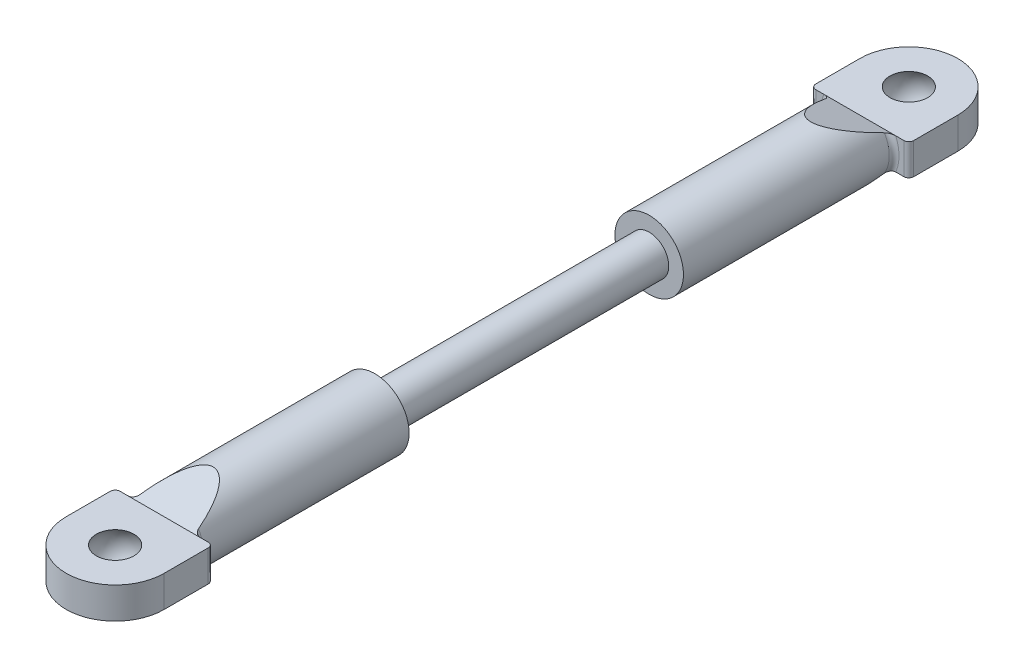
ISO-10303-21;
HEADER;
FILE_DESCRIPTION(('STEP AP214'),'2;1');
FILE_NAME('part.step','',(''),(''),'','','');
FILE_SCHEMA(('AUTOMOTIVE_DESIGN { 1 0 10303 214 1 1 1 1 }'));
ENDSEC;
DATA;
#1=APPLICATION_CONTEXT('core data for automotive mechanical design processes');
#2=APPLICATION_PROTOCOL_DEFINITION('international standard','automotive_design',2000,#1);
#3=PRODUCT_CONTEXT('',#1,'mechanical');
#4=PRODUCT('Part','Part','',(#3));
#5=PRODUCT_RELATED_PRODUCT_CATEGORY('part','',(#4));
#6=PRODUCT_DEFINITION_FORMATION('','',#4);
#7=PRODUCT_DEFINITION_CONTEXT('part definition',#1,'design');
#8=PRODUCT_DEFINITION('design','',#6,#7);
#9=PRODUCT_DEFINITION_SHAPE('','',#8);
#10=(LENGTH_UNIT() NAMED_UNIT(*) SI_UNIT(.MILLI.,.METRE.));
#11=(NAMED_UNIT(*) PLANE_ANGLE_UNIT() SI_UNIT($,.RADIAN.));
#12=(NAMED_UNIT(*) SI_UNIT($,.STERADIAN.) SOLID_ANGLE_UNIT());
#13=UNCERTAINTY_MEASURE_WITH_UNIT(LENGTH_MEASURE(1.E-05),#10,'distance_accuracy_value','');
#14=(GEOMETRIC_REPRESENTATION_CONTEXT(3) GLOBAL_UNCERTAINTY_ASSIGNED_CONTEXT((#13)) GLOBAL_UNIT_ASSIGNED_CONTEXT((#10,
#11,#12)) REPRESENTATION_CONTEXT('',''));
#15=CARTESIAN_POINT('',(0.,0.,0.));
#16=DIRECTION('',(0.,0.,1.));
#17=DIRECTION('',(1.,0.,0.));
#18=AXIS2_PLACEMENT_3D('',#15,#16,#17);
#19=CARTESIAN_POINT('',(0.,0.,-35.5));
#20=DIRECTION('',(0.,0.,1.));
#21=DIRECTION('',(1.,0.,0.));
#22=AXIS2_PLACEMENT_3D('',#19,#20,#21);
#23=CYLINDRICAL_SURFACE('',#22,3.5);
#24=CARTESIAN_POINT('',(0.,0.,-14.));
#25=DIRECTION('',(0.,0.,1.));
#26=DIRECTION('',(1.,0.,0.));
#27=AXIS2_PLACEMENT_3D('',#24,#25,#26);
#28=CIRCLE('',#27,3.5);
#29=CARTESIAN_POINT('',(3.5,0.,-14.));
#30=VERTEX_POINT('',#29);
#31=EDGE_CURVE('E184',#30,#30,#28,.T.);
#32=ORIENTED_EDGE('',*,*,#31,.F.);
#33=EDGE_LOOP('',(#32));
#34=FACE_BOUND('',#33,.T.);
#35=CARTESIAN_POINT('',(0.,0.,-39.7105263157895));
#36=DIRECTION('',(0.,0.934783580588349,-0.355217760623573));
#37=DIRECTION('',(0.,0.355217760623573,0.934783580588349));
#38=AXIS2_PLACEMENT_3D('',#35,#36,#37);
#39=ELLIPSE('',#38,9.8531109307594,3.5);
#40=CARTESIAN_POINT('',(3.00764027104307,1.79,-35.));
#41=VERTEX_POINT('',#40);
#42=CARTESIAN_POINT('',(-3.00764027104307,1.79,-35.));
#43=VERTEX_POINT('',#42);
#44=EDGE_CURVE('E517',#41,#43,#39,.F.);
#45=ORIENTED_EDGE('',*,*,#44,.T.);
#46=CARTESIAN_POINT('',(0.,0.,-35.));
#47=DIRECTION('',(0.,0.,1.));
#48=DIRECTION('',(1.,0.,0.));
#49=AXIS2_PLACEMENT_3D('',#46,#47,#48);
#50=CIRCLE('',#49,3.5);
#51=CARTESIAN_POINT('',(-3.00764027104307,-1.79,-35.));
#52=VERTEX_POINT('',#51);
#53=EDGE_CURVE('E369',#43,#52,#50,.T.);
#54=ORIENTED_EDGE('',*,*,#53,.T.);
#55=CARTESIAN_POINT('',(0.,0.,-39.7105263157895));
#56=DIRECTION('',(0.,-0.934783580588349,-0.355217760623573));
#57=DIRECTION('',(0.,-0.355217760623573,0.934783580588349));
#58=AXIS2_PLACEMENT_3D('',#55,#56,#57);
#59=ELLIPSE('',#58,9.8531109307594,3.5);
#60=CARTESIAN_POINT('',(3.00764027104307,-1.79,-35.));
#61=VERTEX_POINT('',#60);
#62=EDGE_CURVE('E208',#52,#61,#59,.F.);
#63=ORIENTED_EDGE('',*,*,#62,.T.);
#64=CARTESIAN_POINT('',(0.,0.,-35.));
#65=DIRECTION('',(0.,0.,1.));
#66=DIRECTION('',(1.,0.,0.));
#67=AXIS2_PLACEMENT_3D('',#64,#65,#66);
#68=CIRCLE('',#67,3.5);
#69=EDGE_CURVE('E366',#61,#41,#68,.T.);
#70=ORIENTED_EDGE('',*,*,#69,.T.);
#71=EDGE_LOOP('',(#45,#54,#63,#70));
#72=FACE_BOUND('',#71,.T.);
#73=ADVANCED_FACE('F34',(#34,#72),#23,.T.);
#74=CARTESIAN_POINT('',(0.,0.,14.));
#75=DIRECTION('',(0.,0.,-1.));
#76=DIRECTION('',(-1.,0.,0.));
#77=AXIS2_PLACEMENT_3D('',#74,#75,#76);
#78=CYLINDRICAL_SURFACE('',#77,2.);
#79=CARTESIAN_POINT('',(0.,0.,14.));
#80=DIRECTION('',(0.,0.,1.));
#81=DIRECTION('',(1.,0.,0.));
#82=AXIS2_PLACEMENT_3D('',#79,#80,#81);
#83=CIRCLE('',#82,2.);
#84=CARTESIAN_POINT('',(2.,0.,14.));
#85=VERTEX_POINT('',#84);
#86=EDGE_CURVE('E267',#85,#85,#83,.T.);
#87=ORIENTED_EDGE('',*,*,#86,.F.);
#88=EDGE_LOOP('',(#87));
#89=FACE_BOUND('',#88,.T.);
#90=CARTESIAN_POINT('',(0.,0.,-14.));
#91=DIRECTION('',(0.,0.,-1.));
#92=DIRECTION('',(-1.,0.,0.));
#93=AXIS2_PLACEMENT_3D('',#90,#91,#92);
#94=CIRCLE('',#93,2.);
#95=CARTESIAN_POINT('',(-2.,0.,-14.));
#96=VERTEX_POINT('',#95);
#97=EDGE_CURVE('E219',#96,#96,#94,.T.);
#98=ORIENTED_EDGE('',*,*,#97,.F.);
#99=EDGE_LOOP('',(#98));
#100=FACE_BOUND('',#99,.T.);
#101=ADVANCED_FACE('F429',(#89,#100),#78,.T.);
#102=CARTESIAN_POINT('',(0.,0.,35.5));
#103=DIRECTION('',(0.,0.,-1.));
#104=DIRECTION('',(-1.,0.,0.));
#105=AXIS2_PLACEMENT_3D('',#102,#103,#104);
#106=CYLINDRICAL_SURFACE('',#105,3.5);
#107=CARTESIAN_POINT('',(0.,0.,39.7105263157895));
#108=DIRECTION('',(0.,0.934783580588349,-0.355217760623573));
#109=DIRECTION('',(0.,-0.355217760623573,-0.934783580588349));
#110=AXIS2_PLACEMENT_3D('',#107,#108,#109);
#111=ELLIPSE('',#110,9.8531109307594,3.5);
#112=CARTESIAN_POINT('',(3.00764027104307,-1.79,35.));
#113=VERTEX_POINT('',#112);
#114=CARTESIAN_POINT('',(-3.00764027104307,-1.79,35.));
#115=VERTEX_POINT('',#114);
#116=EDGE_CURVE('E231',#113,#115,#111,.T.);
#117=ORIENTED_EDGE('',*,*,#116,.T.);
#118=CARTESIAN_POINT('',(0.,0.,35.));
#119=DIRECTION('',(0.,0.,1.));
#120=DIRECTION('',(1.,0.,0.));
#121=AXIS2_PLACEMENT_3D('',#118,#119,#120);
#122=CIRCLE('',#121,3.5);
#123=CARTESIAN_POINT('',(-3.00764027104307,1.79,35.));
#124=VERTEX_POINT('',#123);
#125=EDGE_CURVE('E288',#115,#124,#122,.F.);
#126=ORIENTED_EDGE('',*,*,#125,.T.);
#127=CARTESIAN_POINT('',(0.,0.,39.7105263157895));
#128=DIRECTION('',(0.,-0.934783580588349,-0.355217760623573));
#129=DIRECTION('',(0.,0.355217760623573,-0.934783580588349));
#130=AXIS2_PLACEMENT_3D('',#127,#128,#129);
#131=ELLIPSE('',#130,9.8531109307594,3.5);
#132=CARTESIAN_POINT('',(3.00764027104307,1.79,35.));
#133=VERTEX_POINT('',#132);
#134=EDGE_CURVE('E228',#124,#133,#131,.T.);
#135=ORIENTED_EDGE('',*,*,#134,.T.);
#136=CARTESIAN_POINT('',(0.,0.,35.));
#137=DIRECTION('',(0.,0.,1.));
#138=DIRECTION('',(1.,0.,0.));
#139=AXIS2_PLACEMENT_3D('',#136,#137,#138);
#140=CIRCLE('',#139,3.5);
#141=EDGE_CURVE('E286',#133,#113,#140,.F.);
#142=ORIENTED_EDGE('',*,*,#141,.T.);
#143=EDGE_LOOP('',(#117,#126,#135,#142));
#144=FACE_BOUND('',#143,.T.);
#145=CARTESIAN_POINT('',(0.,0.,14.));
#146=DIRECTION('',(0.,0.,1.));
#147=DIRECTION('',(1.,0.,0.));
#148=AXIS2_PLACEMENT_3D('',#145,#146,#147);
#149=CIRCLE('',#148,3.5);
#150=CARTESIAN_POINT('',(3.5,0.,14.));
#151=VERTEX_POINT('',#150);
#152=EDGE_CURVE('E264',#151,#151,#149,.T.);
#153=ORIENTED_EDGE('',*,*,#152,.T.);
#154=EDGE_LOOP('',(#153));
#155=FACE_BOUND('',#154,.T.);
#156=ADVANCED_FACE('F490',(#144,#155),#106,.T.);
#157=CARTESIAN_POINT('',(0.,0.,14.));
#158=DIRECTION('',(0.,0.,1.));
#159=DIRECTION('',(1.,0.,0.));
#160=AXIS2_PLACEMENT_3D('',#157,#158,#159);
#161=PLANE('',#160);
#162=ORIENTED_EDGE('',*,*,#86,.T.);
#163=EDGE_LOOP('',(#162));
#164=FACE_BOUND('',#163,.T.);
#165=ORIENTED_EDGE('',*,*,#152,.F.);
#166=EDGE_LOOP('',(#165));
#167=FACE_BOUND('',#166,.T.);
#168=ADVANCED_FACE('F493',(#164,#167),#161,.F.);
#169=CARTESIAN_POINT('',(4.99999999999995,1.6,35.5));
#170=DIRECTION('',(0.,0.,1.));
#171=DIRECTION('',(1.,0.,0.));
#172=AXIS2_PLACEMENT_3D('',#169,#170,#171);
#173=PLANE('',#172);
#174=DIRECTION('',(-1.,0.,0.));
#175=VECTOR('',#174,1.);
#176=CARTESIAN_POINT('',(4.99999999999995,-1.6,35.5));
#177=LINE('',#176,#175);
#178=CARTESIAN_POINT('',(-3.66606055596467,-1.6,35.5));
#179=VERTEX_POINT('',#178);
#180=CARTESIAN_POINT('',(-4.50000000000005,-1.6,35.5));
#181=VERTEX_POINT('',#180);
#182=EDGE_CURVE('E251',#179,#181,#177,.T.);
#183=ORIENTED_EDGE('',*,*,#182,.T.);
#184=DIRECTION('',(0.,-1.,0.));
#185=VECTOR('',#184,1.);
#186=CARTESIAN_POINT('',(-4.50000000000005,1.6,35.5));
#187=LINE('',#186,#185);
#188=CARTESIAN_POINT('',(-4.50000000000005,1.6,35.5));
#189=VERTEX_POINT('',#188);
#190=EDGE_CURVE('E280',#181,#189,#187,.F.);
#191=ORIENTED_EDGE('',*,*,#190,.T.);
#192=DIRECTION('',(-1.,0.,0.));
#193=VECTOR('',#192,1.);
#194=CARTESIAN_POINT('',(4.99999999999995,1.6,35.5));
#195=LINE('',#194,#193);
#196=CARTESIAN_POINT('',(-3.66606055596467,1.6,35.5));
#197=VERTEX_POINT('',#196);
#198=EDGE_CURVE('E238',#197,#189,#195,.T.);
#199=ORIENTED_EDGE('',*,*,#198,.F.);
#200=CARTESIAN_POINT('',(0.,0.,35.5));
#201=DIRECTION('',(0.,0.,1.));
#202=DIRECTION('',(1.,0.,0.));
#203=AXIS2_PLACEMENT_3D('',#200,#201,#202);
#204=CIRCLE('',#203,4.);
#205=EDGE_CURVE('E277',#197,#179,#204,.T.);
#206=ORIENTED_EDGE('',*,*,#205,.T.);
#207=EDGE_LOOP('',(#183,#191,#199,#206));
#208=FACE_BOUND('',#207,.T.);
#209=ADVANCED_FACE('F458',(#208),#173,.F.);
#210=CARTESIAN_POINT('',(4.49999999999995,1.6,35.5));
#211=VERTEX_POINT('',#210);
#212=CARTESIAN_POINT('',(3.66606055596467,1.6,35.5));
#213=VERTEX_POINT('',#212);
#214=EDGE_CURVE('E240',#211,#213,#195,.T.);
#215=ORIENTED_EDGE('',*,*,#214,.F.);
#216=DIRECTION('',(0.,-1.,0.));
#217=VECTOR('',#216,1.);
#218=CARTESIAN_POINT('',(4.49999999999995,1.6,35.5));
#219=LINE('',#218,#217);
#220=CARTESIAN_POINT('',(4.49999999999995,-1.6,35.5));
#221=VERTEX_POINT('',#220);
#222=EDGE_CURVE('E293',#211,#221,#219,.T.);
#223=ORIENTED_EDGE('',*,*,#222,.T.);
#224=CARTESIAN_POINT('',(3.66606055596467,-1.6,35.5));
#225=VERTEX_POINT('',#224);
#226=EDGE_CURVE('E252',#221,#225,#177,.T.);
#227=ORIENTED_EDGE('',*,*,#226,.T.);
#228=CARTESIAN_POINT('',(0.,0.,35.5));
#229=DIRECTION('',(0.,0.,1.));
#230=DIRECTION('',(1.,0.,0.));
#231=AXIS2_PLACEMENT_3D('',#228,#229,#230);
#232=CIRCLE('',#231,4.);
#233=EDGE_CURVE('E290',#225,#213,#232,.T.);
#234=ORIENTED_EDGE('',*,*,#233,.T.);
#235=EDGE_LOOP('',(#215,#223,#227,#234));
#236=FACE_BOUND('',#235,.T.);
#237=ADVANCED_FACE('F486',(#236),#173,.F.);
#238=CARTESIAN_POINT('',(4.99999999999995,1.6,35.5));
#239=DIRECTION('',(-1.,0.,0.));
#240=DIRECTION('',(0.,0.,1.));
#241=AXIS2_PLACEMENT_3D('',#238,#239,#240);
#242=PLANE('',#241);
#243=DIRECTION('',(0.,0.,-1.));
#244=VECTOR('',#243,1.);
#245=CARTESIAN_POINT('',(4.99999999999995,-1.6,35.5));
#246=LINE('',#245,#244);
#247=CARTESIAN_POINT('',(4.99999999999995,-1.6,40.5));
#248=VERTEX_POINT('',#247);
#249=CARTESIAN_POINT('',(4.99999999999995,-1.6,36.));
#250=VERTEX_POINT('',#249);
#251=EDGE_CURVE('E234',#248,#250,#246,.T.);
#252=ORIENTED_EDGE('',*,*,#251,.T.);
#253=DIRECTION('',(0.,-1.,0.));
#254=VECTOR('',#253,1.);
#255=CARTESIAN_POINT('',(4.99999999999995,1.6,36.));
#256=LINE('',#255,#254);
#257=CARTESIAN_POINT('',(4.99999999999995,1.6,36.));
#258=VERTEX_POINT('',#257);
#259=EDGE_CURVE('E296',#250,#258,#256,.F.);
#260=ORIENTED_EDGE('',*,*,#259,.T.);
#261=DIRECTION('',(0.,0.,-1.));
#262=VECTOR('',#261,1.);
#263=CARTESIAN_POINT('',(4.99999999999995,1.6,35.5));
#264=LINE('',#263,#262);
#265=CARTESIAN_POINT('',(4.99999999999995,1.6,40.5));
#266=VERTEX_POINT('',#265);
#267=EDGE_CURVE('E235',#266,#258,#264,.T.);
#268=ORIENTED_EDGE('',*,*,#267,.F.);
#269=DIRECTION('',(0.,-1.,0.));
#270=VECTOR('',#269,1.);
#271=CARTESIAN_POINT('',(4.99999999999995,1.6,40.5));
#272=LINE('',#271,#270);
#273=EDGE_CURVE('E248',#266,#248,#272,.T.);
#274=ORIENTED_EDGE('',*,*,#273,.T.);
#275=EDGE_LOOP('',(#252,#260,#268,#274));
#276=FACE_BOUND('',#275,.T.);
#277=ADVANCED_FACE('F480',(#276),#242,.F.);
#278=CARTESIAN_POINT('',(-5.00000000000005,1.6,35.5));
#279=DIRECTION('',(1.,0.,0.));
#280=DIRECTION('',(0.,0.,-1.));
#281=AXIS2_PLACEMENT_3D('',#278,#279,#280);
#282=PLANE('',#281);
#283=DIRECTION('',(0.,0.,1.));
#284=VECTOR('',#283,1.);
#285=CARTESIAN_POINT('',(-5.00000000000005,1.6,35.5));
#286=LINE('',#285,#284);
#287=CARTESIAN_POINT('',(-5.00000000000005,1.6,36.));
#288=VERTEX_POINT('',#287);
#289=CARTESIAN_POINT('',(-5.00000000000005,1.6,40.5));
#290=VERTEX_POINT('',#289);
#291=EDGE_CURVE('E243',#288,#290,#286,.T.);
#292=ORIENTED_EDGE('',*,*,#291,.F.);
#293=DIRECTION('',(0.,-1.,0.));
#294=VECTOR('',#293,1.);
#295=CARTESIAN_POINT('',(-5.00000000000005,1.6,36.));
#296=LINE('',#295,#294);
#297=CARTESIAN_POINT('',(-5.00000000000005,-1.6,36.));
#298=VERTEX_POINT('',#297);
#299=EDGE_CURVE('E270',#288,#298,#296,.T.);
#300=ORIENTED_EDGE('',*,*,#299,.T.);
#301=DIRECTION('',(0.,0.,1.));
#302=VECTOR('',#301,1.);
#303=CARTESIAN_POINT('',(-5.00000000000005,-1.6,35.5));
#304=LINE('',#303,#302);
#305=CARTESIAN_POINT('',(-5.00000000000005,-1.6,40.5));
#306=VERTEX_POINT('',#305);
#307=EDGE_CURVE('E255',#298,#306,#304,.T.);
#308=ORIENTED_EDGE('',*,*,#307,.T.);
#309=DIRECTION('',(0.,-1.,0.));
#310=VECTOR('',#309,1.);
#311=CARTESIAN_POINT('',(-5.00000000000005,1.6,40.5));
#312=LINE('',#311,#310);
#313=EDGE_CURVE('E261',#290,#306,#312,.T.);
#314=ORIENTED_EDGE('',*,*,#313,.F.);
#315=EDGE_LOOP('',(#292,#300,#308,#314));
#316=FACE_BOUND('',#315,.T.);
#317=ADVANCED_FACE('F470',(#316),#282,.F.);
#318=CARTESIAN_POINT('',(0.,1.6,40.5));
#319=DIRECTION('',(0.,-1.,0.));
#320=DIRECTION('',(0.,0.,-1.));
#321=AXIS2_PLACEMENT_3D('',#318,#319,#320);
#322=CYLINDRICAL_SURFACE('',#321,5.);
#323=CARTESIAN_POINT('',(0.,-1.6,40.5));
#324=DIRECTION('',(0.,1.,0.));
#325=DIRECTION('',(0.,0.,1.));
#326=AXIS2_PLACEMENT_3D('',#323,#324,#325);
#327=CIRCLE('',#326,5.);
#328=EDGE_CURVE('E239',#306,#248,#327,.T.);
#329=ORIENTED_EDGE('',*,*,#328,.T.);
#330=ORIENTED_EDGE('',*,*,#273,.F.);
#331=CARTESIAN_POINT('',(0.,1.6,40.5));
#332=DIRECTION('',(0.,1.,0.));
#333=DIRECTION('',(0.,0.,1.));
#334=AXIS2_PLACEMENT_3D('',#331,#332,#333);
#335=CIRCLE('',#334,5.);
#336=EDGE_CURVE('E246',#290,#266,#335,.T.);
#337=ORIENTED_EDGE('',*,*,#336,.F.);
#338=ORIENTED_EDGE('',*,*,#313,.T.);
#339=EDGE_LOOP('',(#329,#330,#337,#338));
#340=FACE_BOUND('',#339,.T.);
#341=ADVANCED_FACE('F476',(#340),#322,.T.);
#342=CARTESIAN_POINT('',(0.,1.6,40.5));
#343=DIRECTION('',(0.,1.,0.));
#344=DIRECTION('',(0.,0.,1.));
#345=AXIS2_PLACEMENT_3D('',#342,#343,#344);
#346=PLANE('',#345);
#347=CARTESIAN_POINT('',(0.,1.6,40.5));
#348=DIRECTION('',(0.,-1.,0.));
#349=DIRECTION('',(0.,0.,-1.));
#350=AXIS2_PLACEMENT_3D('',#347,#348,#349);
#351=CIRCLE('',#350,1.92093727122986);
#352=CARTESIAN_POINT('',(0.,1.6,38.5790627287701));
#353=VERTEX_POINT('',#352);
#354=EDGE_CURVE('E225',#353,#353,#351,.T.);
#355=ORIENTED_EDGE('',*,*,#354,.T.);
#356=EDGE_LOOP('',(#355));
#357=FACE_BOUND('',#356,.T.);
#358=ORIENTED_EDGE('',*,*,#198,.T.);
#359=CARTESIAN_POINT('',(-4.50000000000005,1.6,36.));
#360=DIRECTION('',(0.,1.,0.));
#361=DIRECTION('',(0.,0.,1.));
#362=AXIS2_PLACEMENT_3D('',#359,#360,#361);
#363=CIRCLE('',#362,0.5);
#364=EDGE_CURVE('E284',#189,#288,#363,.T.);
#365=ORIENTED_EDGE('',*,*,#364,.T.);
#366=ORIENTED_EDGE('',*,*,#291,.T.);
#367=ORIENTED_EDGE('',*,*,#336,.T.);
#368=ORIENTED_EDGE('',*,*,#267,.T.);
#369=CARTESIAN_POINT('',(4.49999999999995,1.6,36.));
#370=DIRECTION('',(0.,1.,0.));
#371=DIRECTION('',(0.,0.,1.));
#372=AXIS2_PLACEMENT_3D('',#369,#370,#371);
#373=CIRCLE('',#372,0.5);
#374=EDGE_CURVE('E282',#258,#211,#373,.T.);
#375=ORIENTED_EDGE('',*,*,#374,.T.);
#376=ORIENTED_EDGE('',*,*,#214,.T.);
#377=EDGE_CURVE('E244',#213,#197,#195,.T.);
#378=ORIENTED_EDGE('',*,*,#377,.T.);
#379=EDGE_LOOP('',(#358,#365,#366,#367,#368,#375,#376,#378));
#380=FACE_BOUND('',#379,.T.);
#381=ADVANCED_FACE('F466',(#357,#380),#346,.T.);
#382=CARTESIAN_POINT('',(0.,-1.6,40.5));
#383=DIRECTION('',(0.,1.,0.));
#384=DIRECTION('',(0.,0.,1.));
#385=AXIS2_PLACEMENT_3D('',#382,#383,#384);
#386=PLANE('',#385);
#387=CARTESIAN_POINT('',(0.,-1.6,40.5));
#388=DIRECTION('',(0.,-1.,0.));
#389=DIRECTION('',(0.,0.,-1.));
#390=AXIS2_PLACEMENT_3D('',#387,#388,#389);
#391=CIRCLE('',#390,1.92093727122986);
#392=CARTESIAN_POINT('',(0.,-1.6,38.5790627287701));
#393=VERTEX_POINT('',#392);
#394=EDGE_CURVE('E222',#393,#393,#391,.T.);
#395=ORIENTED_EDGE('',*,*,#394,.F.);
#396=EDGE_LOOP('',(#395));
#397=FACE_BOUND('',#396,.T.);
#398=ORIENTED_EDGE('',*,*,#307,.F.);
#399=CARTESIAN_POINT('',(-4.50000000000005,-1.6,36.));
#400=DIRECTION('',(0.,1.,0.));
#401=DIRECTION('',(0.,0.,1.));
#402=AXIS2_PLACEMENT_3D('',#399,#400,#401);
#403=CIRCLE('',#402,0.5);
#404=EDGE_CURVE('E275',#298,#181,#403,.F.);
#405=ORIENTED_EDGE('',*,*,#404,.T.);
#406=ORIENTED_EDGE('',*,*,#182,.F.);
#407=EDGE_CURVE('E256',#225,#179,#177,.T.);
#408=ORIENTED_EDGE('',*,*,#407,.F.);
#409=ORIENTED_EDGE('',*,*,#226,.F.);
#410=CARTESIAN_POINT('',(4.49999999999995,-1.6,36.));
#411=DIRECTION('',(0.,1.,0.));
#412=DIRECTION('',(0.,0.,1.));
#413=AXIS2_PLACEMENT_3D('',#410,#411,#412);
#414=CIRCLE('',#413,0.5);
#415=EDGE_CURVE('E273',#221,#250,#414,.F.);
#416=ORIENTED_EDGE('',*,*,#415,.T.);
#417=ORIENTED_EDGE('',*,*,#251,.F.);
#418=ORIENTED_EDGE('',*,*,#328,.F.);
#419=EDGE_LOOP('',(#398,#405,#406,#408,#409,#416,#417,#418));
#420=FACE_BOUND('',#419,.T.);
#421=ADVANCED_FACE('F443',(#397,#420),#386,.F.);
#422=CARTESIAN_POINT('',(-5.00000000000005,-3.5,30.5));
#423=DIRECTION('',(0.,0.934783580588349,-0.355217760623573));
#424=DIRECTION('',(0.,0.355217760623573,0.934783580588349));
#425=AXIS2_PLACEMENT_3D('',#422,#423,#424);
#426=PLANE('',#425);
#427=ORIENTED_EDGE('',*,*,#116,.F.);
#428=CARTESIAN_POINT('',(3.00764027104307,-1.79,35.));
#429=CARTESIAN_POINT('',(3.01501660801302,-1.77766028795213,35.0324729264418));
#430=CARTESIAN_POINT('',(3.02572054444839,-1.76562370557432,35.0641481432255));
#431=CARTESIAN_POINT('',(3.05268143397384,-1.74243941655702,35.1251594301131));
#432=CARTESIAN_POINT('',(3.06890462643524,-1.73128680248825,35.1545084145046));
#433=CARTESIAN_POINT('',(3.10582578109096,-1.71005107968239,35.2103918955726));
#434=CARTESIAN_POINT('',(3.12650175541777,-1.69996306618932,35.2369392995018));
#435=CARTESIAN_POINT('',(3.17173377932212,-1.68091062474513,35.2870773033023));
#436=CARTESIAN_POINT('',(3.19630000983909,-1.67194925885705,35.310659845113));
#437=CARTESIAN_POINT('',(3.25308702665305,-1.65394324157303,35.3580441011236));
#438=CARTESIAN_POINT('',(3.28590126291054,-1.64513316555967,35.3812285116851));
#439=CARTESIAN_POINT('',(3.35512262024705,-1.62958502321958,35.4221446757379));
#440=CARTESIAN_POINT('',(3.39152193222907,-1.62284257946172,35.4398879487849));
#441=CARTESIAN_POINT('',(3.46667654312686,-1.61181855552478,35.4688985380927));
#442=CARTESIAN_POINT('',(3.50539569079468,-1.60750655943475,35.4802458962243));
#443=CARTESIAN_POINT('',(3.58468972563839,-1.60158887924979,35.4958187388163));
#444=CARTESIAN_POINT('',(3.62527552224046,-1.60000196579963,35.4999948268431));
#445=CARTESIAN_POINT('',(3.66606055596467,-1.6,35.5));
#446=B_SPLINE_CURVE_WITH_KNOTS('',3,(#428,#429,#430,#431,#432,#433,#434,#435,#436,#437,#438,
#439,#440,#441,#442,#443,#444,#445),.UNSPECIFIED.,.F.,.F.,(4,2,2,2,2,2,2,2,4),(0.,
0.106167992198204,0.211697907824557,0.316718199165376,0.422018018143723,0.544850735918061,
0.667421577236032,0.788422358006247,0.910253310178007),.UNSPECIFIED.);
#447=EDGE_CURVE('E344',#113,#225,#446,.T.);
#448=ORIENTED_EDGE('',*,*,#447,.T.);
#449=ORIENTED_EDGE('',*,*,#407,.T.);
#450=CARTESIAN_POINT('',(-3.66606055596467,-1.6,35.5));
#451=CARTESIAN_POINT('',(-3.63078063888977,-1.60000001056058,35.499999972209));
#452=CARTESIAN_POINT('',(-3.5956179181408,-1.60118986581098,35.4968687741816));
#453=CARTESIAN_POINT('',(-3.52655388189509,-1.60567025143002,35.4850782857105));
#454=CARTESIAN_POINT('',(-3.49264665949915,-1.60894911259673,35.4764497036928));
#455=CARTESIAN_POINT('',(-3.42683574135487,-1.61731864154893,35.4544246275028));
#456=CARTESIAN_POINT('',(-3.39492497711937,-1.62240243525608,35.4410462230103));
#457=CARTESIAN_POINT('',(-3.33346675755787,-1.63416518792784,35.4100916107162));
#458=CARTESIAN_POINT('',(-3.30392365430699,-1.64084699836385,35.3925078990425));
#459=CARTESIAN_POINT('',(-3.24361803739982,-1.65669629654687,35.3507992196135));
#460=CARTESIAN_POINT('',(-3.21331454976661,-1.66608478340738,35.3260926752437));
#461=CARTESIAN_POINT('',(-3.15729695298565,-1.68646854640408,35.2724511936735));
#462=CARTESIAN_POINT('',(-3.13158499781673,-1.69746457229264,35.2435142834404));
#463=CARTESIAN_POINT('',(-3.08849280363673,-1.71942769351274,35.1857165960191));
#464=CARTESIAN_POINT('',(-3.07048210952563,-1.73023882163715,35.1572662588496));
#465=CARTESIAN_POINT('',(-3.03967295120166,-1.7527379284266,35.0980580830879));
#466=CARTESIAN_POINT('',(-3.02685556067101,-1.76442253590269,35.0673091160455));
#467=CARTESIAN_POINT('',(-3.01354455450079,-1.7809023956061,35.0239410641945));
#468=CARTESIAN_POINT('',(-3.01035806349222,-1.78543358828867,35.0120168729246));
#469=CARTESIAN_POINT('',(-3.00764027104306,-1.79,35.));
#470=B_SPLINE_CURVE_WITH_KNOTS('',3,(#450,#451,#452,#453,#454,#455,#456,#457,#458,#459,#460,
#461,#462,#463,#464,#465,#466,#467,#468,#469),.UNSPECIFIED.,.F.,.F.,(4,2,2,2,2,2,2,2,2,4),(0.,
0.105514918398724,0.210445536564004,0.314980739690672,0.419703883801088,0.539819680998126,
0.659991679707302,0.765692662085833,0.871004889168675,0.910420537913499),.UNSPECIFIED.);
#471=EDGE_CURVE('E298',#179,#115,#470,.T.);
#472=ORIENTED_EDGE('',*,*,#471,.T.);
#473=EDGE_LOOP('',(#427,#448,#449,#472));
#474=FACE_BOUND('',#473,.T.);
#475=ADVANCED_FACE('F313',(#474),#426,.F.);
#476=CARTESIAN_POINT('',(-5.00000000000005,3.5,30.5));
#477=DIRECTION('',(0.,-0.934783580588349,-0.355217760623573));
#478=DIRECTION('',(0.,0.355217760623573,-0.934783580588349));
#479=AXIS2_PLACEMENT_3D('',#476,#477,#478);
#480=PLANE('',#479);
#481=ORIENTED_EDGE('',*,*,#134,.F.);
#482=CARTESIAN_POINT('',(-3.00764027104307,1.79,35.));
#483=CARTESIAN_POINT('',(-3.01501660801302,1.77766028795213,35.0324729264418));
#484=CARTESIAN_POINT('',(-3.02572054444839,1.76562370557432,35.0641481432255));
#485=CARTESIAN_POINT('',(-3.05268143397384,1.74243941655702,35.1251594301131));
#486=CARTESIAN_POINT('',(-3.06890462643524,1.73128680248825,35.1545084145046));
#487=CARTESIAN_POINT('',(-3.10582578109096,1.71005107968239,35.2103918955726));
#488=CARTESIAN_POINT('',(-3.12650175541777,1.69996306618932,35.2369392995018));
#489=CARTESIAN_POINT('',(-3.17173377932212,1.68091062474513,35.2870773033023));
#490=CARTESIAN_POINT('',(-3.19630000983909,1.67194925885705,35.310659845113));
#491=CARTESIAN_POINT('',(-3.25308702665305,1.65394324157303,35.3580441011236));
#492=CARTESIAN_POINT('',(-3.28590126291054,1.64513316555967,35.3812285116851));
#493=CARTESIAN_POINT('',(-3.35512262024705,1.62958502321958,35.4221446757379));
#494=CARTESIAN_POINT('',(-3.39152193222907,1.62284257946172,35.4398879487849));
#495=CARTESIAN_POINT('',(-3.46667654312686,1.61181855552478,35.4688985380927));
#496=CARTESIAN_POINT('',(-3.50539569079468,1.60750655943475,35.4802458962243));
#497=CARTESIAN_POINT('',(-3.58468972563839,1.60158887924979,35.4958187388163));
#498=CARTESIAN_POINT('',(-3.62527552224046,1.60000196579963,35.4999948268431));
#499=CARTESIAN_POINT('',(-3.66606055596467,1.6,35.5));
#500=B_SPLINE_CURVE_WITH_KNOTS('',3,(#482,#483,#484,#485,#486,#487,#488,#489,#490,#491,#492,
#493,#494,#495,#496,#497,#498,#499),.UNSPECIFIED.,.F.,.F.,(4,2,2,2,2,2,2,2,4),(0.,
0.106167992198204,0.211697907824557,0.316718199165376,0.422018018143723,0.544850735918061,
0.667421577236032,0.788422358006247,0.910253310178007),.UNSPECIFIED.);
#501=EDGE_CURVE('E306',#124,#197,#500,.T.);
#502=ORIENTED_EDGE('',*,*,#501,.T.);
#503=ORIENTED_EDGE('',*,*,#377,.F.);
#504=CARTESIAN_POINT('',(3.66606055596467,1.6,35.5));
#505=CARTESIAN_POINT('',(3.63078063888977,1.60000001056058,35.499999972209));
#506=CARTESIAN_POINT('',(3.5956179181408,1.60118986581098,35.4968687741816));
#507=CARTESIAN_POINT('',(3.52655388189509,1.60567025143002,35.4850782857105));
#508=CARTESIAN_POINT('',(3.49264665949915,1.60894911259673,35.4764497036928));
#509=CARTESIAN_POINT('',(3.42683574135487,1.61731864154893,35.4544246275028));
#510=CARTESIAN_POINT('',(3.39492497711937,1.62240243525608,35.4410462230103));
#511=CARTESIAN_POINT('',(3.33346675755787,1.63416518792784,35.4100916107162));
#512=CARTESIAN_POINT('',(3.30392365430699,1.64084699836385,35.3925078990425));
#513=CARTESIAN_POINT('',(3.24361803739982,1.65669629654687,35.3507992196135));
#514=CARTESIAN_POINT('',(3.21331454976661,1.66608478340738,35.3260926752437));
#515=CARTESIAN_POINT('',(3.15729695298565,1.68646854640408,35.2724511936735));
#516=CARTESIAN_POINT('',(3.13158499781673,1.69746457229264,35.2435142834404));
#517=CARTESIAN_POINT('',(3.08849280363673,1.71942769351274,35.1857165960191));
#518=CARTESIAN_POINT('',(3.07048210952563,1.73023882163715,35.1572662588496));
#519=CARTESIAN_POINT('',(3.03967295120166,1.7527379284266,35.0980580830879));
#520=CARTESIAN_POINT('',(3.02685556067101,1.76442253590269,35.0673091160455));
#521=CARTESIAN_POINT('',(3.01354455450079,1.7809023956061,35.0239410641945));
#522=CARTESIAN_POINT('',(3.01035806349222,1.78543358828867,35.0120168729246));
#523=CARTESIAN_POINT('',(3.00764027104306,1.79,35.));
#524=B_SPLINE_CURVE_WITH_KNOTS('',3,(#504,#505,#506,#507,#508,#509,#510,#511,#512,#513,#514,
#515,#516,#517,#518,#519,#520,#521,#522,#523),.UNSPECIFIED.,.F.,.F.,(4,2,2,2,2,2,2,2,2,4),(0.,
0.105514918398724,0.210445536564004,0.314980739690672,0.419703883801088,0.539819680998126,
0.659991679707301,0.765692662085833,0.871004889168674,0.910420537913499),.UNSPECIFIED.);
#525=EDGE_CURVE('E338',#213,#133,#524,.T.);
#526=ORIENTED_EDGE('',*,*,#525,.T.);
#527=EDGE_LOOP('',(#481,#502,#503,#526));
#528=FACE_BOUND('',#527,.T.);
#529=ADVANCED_FACE('F433',(#528),#480,.F.);
#530=CARTESIAN_POINT('',(-4.50000000000005,1.6,36.));
#531=DIRECTION('',(0.,-1.,0.));
#532=DIRECTION('',(0.,0.,-1.));
#533=AXIS2_PLACEMENT_3D('',#530,#531,#532);
#534=CYLINDRICAL_SURFACE('',#533,0.5);
#535=ORIENTED_EDGE('',*,*,#364,.F.);
#536=ORIENTED_EDGE('',*,*,#190,.F.);
#537=ORIENTED_EDGE('',*,*,#404,.F.);
#538=ORIENTED_EDGE('',*,*,#299,.F.);
#539=EDGE_LOOP('',(#535,#536,#537,#538));
#540=FACE_BOUND('',#539,.T.);
#541=ADVANCED_FACE('F322',(#540),#534,.T.);
#542=CARTESIAN_POINT('',(0.,0.,35.));
#543=DIRECTION('',(0.,0.,1.));
#544=DIRECTION('',(1.,0.,0.));
#545=AXIS2_PLACEMENT_3D('',#542,#543,#544);
#546=TOROIDAL_SURFACE('',#545,4.,0.5);
#547=ORIENTED_EDGE('',*,*,#501,.F.);
#548=ORIENTED_EDGE('',*,*,#125,.F.);
#549=ORIENTED_EDGE('',*,*,#471,.F.);
#550=ORIENTED_EDGE('',*,*,#205,.F.);
#551=EDGE_LOOP('',(#547,#548,#549,#550));
#552=FACE_BOUND('',#551,.T.);
#553=ADVANCED_FACE('F316',(#552),#546,.F.);
#554=CARTESIAN_POINT('',(4.49999999999995,1.6,36.));
#555=DIRECTION('',(0.,-1.,0.));
#556=DIRECTION('',(0.,0.,-1.));
#557=AXIS2_PLACEMENT_3D('',#554,#555,#556);
#558=CYLINDRICAL_SURFACE('',#557,0.5);
#559=ORIENTED_EDGE('',*,*,#374,.F.);
#560=ORIENTED_EDGE('',*,*,#259,.F.);
#561=ORIENTED_EDGE('',*,*,#415,.F.);
#562=ORIENTED_EDGE('',*,*,#222,.F.);
#563=EDGE_LOOP('',(#559,#560,#561,#562));
#564=FACE_BOUND('',#563,.T.);
#565=ADVANCED_FACE('F321',(#564),#558,.T.);
#566=CARTESIAN_POINT('',(0.,0.,35.));
#567=DIRECTION('',(0.,0.,1.));
#568=DIRECTION('',(1.,0.,0.));
#569=AXIS2_PLACEMENT_3D('',#566,#567,#568);
#570=TOROIDAL_SURFACE('',#569,4.,0.5);
#571=ORIENTED_EDGE('',*,*,#447,.F.);
#572=ORIENTED_EDGE('',*,*,#141,.F.);
#573=ORIENTED_EDGE('',*,*,#525,.F.);
#574=ORIENTED_EDGE('',*,*,#233,.F.);
#575=EDGE_LOOP('',(#571,#572,#573,#574));
#576=FACE_BOUND('',#575,.T.);
#577=ADVANCED_FACE('F328',(#576),#570,.F.);
#578=CARTESIAN_POINT('',(0.,0.,40.5));
#579=DIRECTION('',(0.,-1.,0.));
#580=DIRECTION('',(0.,0.,1.));
#581=AXIS2_PLACEMENT_3D('',#578,#579,#580);
#582=SPHERICAL_SURFACE('',#581,2.5);
#583=ORIENTED_EDGE('',*,*,#394,.T.);
#584=EDGE_LOOP('',(#583));
#585=FACE_BOUND('',#584,.T.);
#586=ORIENTED_EDGE('',*,*,#354,.F.);
#587=EDGE_LOOP('',(#586));
#588=FACE_BOUND('',#587,.T.);
#589=ADVANCED_FACE('F333',(#585,#588),#582,.F.);
#590=CARTESIAN_POINT('',(0.,0.,-14.));
#591=DIRECTION('',(0.,0.,-1.));
#592=DIRECTION('',(1.,0.,0.));
#593=AXIS2_PLACEMENT_3D('',#590,#591,#592);
#594=PLANE('',#593);
#595=ORIENTED_EDGE('',*,*,#97,.T.);
#596=EDGE_LOOP('',(#595));
#597=FACE_BOUND('',#596,.T.);
#598=ORIENTED_EDGE('',*,*,#31,.T.);
#599=EDGE_LOOP('',(#598));
#600=FACE_BOUND('',#599,.T.);
#601=ADVANCED_FACE('F415',(#597,#600),#594,.F.);
#602=CARTESIAN_POINT('',(4.99999999999995,1.6,-35.5));
#603=DIRECTION('',(0.,0.,1.));
#604=DIRECTION('',(1.,0.,0.));
#605=AXIS2_PLACEMENT_3D('',#602,#603,#604);
#606=PLANE('',#605);
#607=DIRECTION('',(-1.,0.,0.));
#608=VECTOR('',#607,1.);
#609=CARTESIAN_POINT('',(4.99999999999995,1.6,-35.5));
#610=LINE('',#609,#608);
#611=CARTESIAN_POINT('',(-3.66606055596467,1.6,-35.5));
#612=VERTEX_POINT('',#611);
#613=CARTESIAN_POINT('',(-4.50000000000005,1.6,-35.5));
#614=VERTEX_POINT('',#613);
#615=EDGE_CURVE('E200',#612,#614,#610,.T.);
#616=ORIENTED_EDGE('',*,*,#615,.T.);
#617=DIRECTION('',(0.,-1.,0.));
#618=VECTOR('',#617,1.);
#619=CARTESIAN_POINT('',(-4.50000000000005,1.6,-35.5));
#620=LINE('',#619,#618);
#621=CARTESIAN_POINT('',(-4.50000000000005,-1.6,-35.5));
#622=VERTEX_POINT('',#621);
#623=EDGE_CURVE('E354',#614,#622,#620,.T.);
#624=ORIENTED_EDGE('',*,*,#623,.T.);
#625=DIRECTION('',(-1.,0.,0.));
#626=VECTOR('',#625,1.);
#627=CARTESIAN_POINT('',(4.99999999999995,-1.6,-35.5));
#628=LINE('',#627,#626);
#629=CARTESIAN_POINT('',(-3.66606055596467,-1.6,-35.5));
#630=VERTEX_POINT('',#629);
#631=EDGE_CURVE('E212',#630,#622,#628,.T.);
#632=ORIENTED_EDGE('',*,*,#631,.F.);
#633=CARTESIAN_POINT('',(0.,0.,-35.5));
#634=DIRECTION('',(0.,0.,1.));
#635=DIRECTION('',(1.,0.,0.));
#636=AXIS2_PLACEMENT_3D('',#633,#634,#635);
#637=CIRCLE('',#636,4.);
#638=EDGE_CURVE('E351',#630,#612,#637,.F.);
#639=ORIENTED_EDGE('',*,*,#638,.T.);
#640=EDGE_LOOP('',(#616,#624,#632,#639));
#641=FACE_BOUND('',#640,.T.);
#642=ADVANCED_FACE('F411',(#641),#606,.T.);
#643=CARTESIAN_POINT('',(4.49999999999995,-1.6,-35.5));
#644=VERTEX_POINT('',#643);
#645=CARTESIAN_POINT('',(3.66606055596467,-1.6,-35.5));
#646=VERTEX_POINT('',#645);
#647=EDGE_CURVE('E193',#644,#646,#628,.T.);
#648=ORIENTED_EDGE('',*,*,#647,.F.);
#649=DIRECTION('',(0.,-1.,0.));
#650=VECTOR('',#649,1.);
#651=CARTESIAN_POINT('',(4.49999999999995,1.6,-35.5));
#652=LINE('',#651,#650);
#653=CARTESIAN_POINT('',(4.49999999999995,1.6,-35.5));
#654=VERTEX_POINT('',#653);
#655=EDGE_CURVE('E377',#644,#654,#652,.F.);
#656=ORIENTED_EDGE('',*,*,#655,.T.);
#657=CARTESIAN_POINT('',(3.66606055596467,1.6,-35.5));
#658=VERTEX_POINT('',#657);
#659=EDGE_CURVE('E204',#654,#658,#610,.T.);
#660=ORIENTED_EDGE('',*,*,#659,.T.);
#661=CARTESIAN_POINT('',(0.,0.,-35.5));
#662=DIRECTION('',(0.,0.,1.));
#663=DIRECTION('',(1.,0.,0.));
#664=AXIS2_PLACEMENT_3D('',#661,#662,#663);
#665=CIRCLE('',#664,4.);
#666=EDGE_CURVE('E374',#658,#646,#665,.F.);
#667=ORIENTED_EDGE('',*,*,#666,.T.);
#668=EDGE_LOOP('',(#648,#656,#660,#667));
#669=FACE_BOUND('',#668,.T.);
#670=ADVANCED_FACE('F414',(#669),#606,.T.);
#671=CARTESIAN_POINT('',(4.99999999999995,1.6,-35.5));
#672=DIRECTION('',(1.,0.,0.));
#673=DIRECTION('',(0.,0.,-1.));
#674=AXIS2_PLACEMENT_3D('',#671,#672,#673);
#675=PLANE('',#674);
#676=DIRECTION('',(0.,0.,1.));
#677=VECTOR('',#676,1.);
#678=CARTESIAN_POINT('',(4.99999999999995,1.6,-35.5));
#679=LINE('',#678,#677);
#680=CARTESIAN_POINT('',(4.99999999999995,1.6,-40.5));
#681=VERTEX_POINT('',#680);
#682=CARTESIAN_POINT('',(4.99999999999995,1.6,-36.));
#683=VERTEX_POINT('',#682);
#684=EDGE_CURVE('E176',#681,#683,#679,.T.);
#685=ORIENTED_EDGE('',*,*,#684,.T.);
#686=DIRECTION('',(0.,-1.,0.));
#687=VECTOR('',#686,1.);
#688=CARTESIAN_POINT('',(4.99999999999995,1.6,-36.));
#689=LINE('',#688,#687);
#690=CARTESIAN_POINT('',(4.99999999999995,-1.6,-36.));
#691=VERTEX_POINT('',#690);
#692=EDGE_CURVE('E372',#683,#691,#689,.T.);
#693=ORIENTED_EDGE('',*,*,#692,.T.);
#694=DIRECTION('',(0.,0.,1.));
#695=VECTOR('',#694,1.);
#696=CARTESIAN_POINT('',(4.99999999999995,-1.6,-35.5));
#697=LINE('',#696,#695);
#698=CARTESIAN_POINT('',(4.99999999999995,-1.6,-40.5));
#699=VERTEX_POINT('',#698);
#700=EDGE_CURVE('E179',#699,#691,#697,.T.);
#701=ORIENTED_EDGE('',*,*,#700,.F.);
#702=DIRECTION('',(0.,-1.,0.));
#703=VECTOR('',#702,1.);
#704=CARTESIAN_POINT('',(4.99999999999995,1.6,-40.5));
#705=LINE('',#704,#703);
#706=EDGE_CURVE('E172',#681,#699,#705,.T.);
#707=ORIENTED_EDGE('',*,*,#706,.F.);
#708=EDGE_LOOP('',(#685,#693,#701,#707));
#709=FACE_BOUND('',#708,.T.);
#710=ADVANCED_FACE('F174',(#709),#675,.T.);
#711=CARTESIAN_POINT('',(0.,1.6,-40.5));
#712=DIRECTION('',(0.,-1.,0.));
#713=DIRECTION('',(0.,0.,-1.));
#714=AXIS2_PLACEMENT_3D('',#711,#712,#713);
#715=CYLINDRICAL_SURFACE('',#714,5.);
#716=CARTESIAN_POINT('',(0.,-1.6,-40.5));
#717=DIRECTION('',(0.,-1.,0.));
#718=DIRECTION('',(0.,0.,-1.));
#719=AXIS2_PLACEMENT_3D('',#716,#717,#718);
#720=CIRCLE('',#719,5.);
#721=CARTESIAN_POINT('',(-5.00000000000005,-1.6,-40.5));
#722=VERTEX_POINT('',#721);
#723=EDGE_CURVE('E207',#722,#699,#720,.T.);
#724=ORIENTED_EDGE('',*,*,#723,.F.);
#725=DIRECTION('',(0.,-1.,0.));
#726=VECTOR('',#725,1.);
#727=CARTESIAN_POINT('',(-5.00000000000005,1.6,-40.5));
#728=LINE('',#727,#726);
#729=CARTESIAN_POINT('',(-5.00000000000005,1.6,-40.5));
#730=VERTEX_POINT('',#729);
#731=EDGE_CURVE('E185',#730,#722,#728,.T.);
#732=ORIENTED_EDGE('',*,*,#731,.F.);
#733=CARTESIAN_POINT('',(0.,1.6,-40.5));
#734=DIRECTION('',(0.,-1.,0.));
#735=DIRECTION('',(0.,0.,-1.));
#736=AXIS2_PLACEMENT_3D('',#733,#734,#735);
#737=CIRCLE('',#736,5.);
#738=EDGE_CURVE('E190',#730,#681,#737,.T.);
#739=ORIENTED_EDGE('',*,*,#738,.T.);
#740=ORIENTED_EDGE('',*,*,#706,.T.);
#741=EDGE_LOOP('',(#724,#732,#739,#740));
#742=FACE_BOUND('',#741,.T.);
#743=ADVANCED_FACE('F196',(#742),#715,.T.);
#744=CARTESIAN_POINT('',(-5.00000000000005,1.6,-35.5));
#745=DIRECTION('',(-1.,0.,0.));
#746=DIRECTION('',(0.,0.,1.));
#747=AXIS2_PLACEMENT_3D('',#744,#745,#746);
#748=PLANE('',#747);
#749=DIRECTION('',(0.,0.,-1.));
#750=VECTOR('',#749,1.);
#751=CARTESIAN_POINT('',(-5.00000000000005,-1.6,-35.5));
#752=LINE('',#751,#750);
#753=CARTESIAN_POINT('',(-5.00000000000005,-1.6,-36.));
#754=VERTEX_POINT('',#753);
#755=EDGE_CURVE('E210',#754,#722,#752,.T.);
#756=ORIENTED_EDGE('',*,*,#755,.F.);
#757=DIRECTION('',(0.,-1.,0.));
#758=VECTOR('',#757,1.);
#759=CARTESIAN_POINT('',(-5.00000000000005,1.6,-36.));
#760=LINE('',#759,#758);
#761=CARTESIAN_POINT('',(-5.00000000000005,1.6,-36.));
#762=VERTEX_POINT('',#761);
#763=EDGE_CURVE('E361',#754,#762,#760,.F.);
#764=ORIENTED_EDGE('',*,*,#763,.T.);
#765=DIRECTION('',(0.,0.,-1.));
#766=VECTOR('',#765,1.);
#767=CARTESIAN_POINT('',(-5.00000000000005,1.6,-35.5));
#768=LINE('',#767,#766);
#769=EDGE_CURVE('E198',#762,#730,#768,.T.);
#770=ORIENTED_EDGE('',*,*,#769,.T.);
#771=ORIENTED_EDGE('',*,*,#731,.T.);
#772=EDGE_LOOP('',(#756,#764,#770,#771));
#773=FACE_BOUND('',#772,.T.);
#774=ADVANCED_FACE('F406',(#773),#748,.T.);
#775=CARTESIAN_POINT('',(0.,1.6,-40.5));
#776=DIRECTION('',(0.,1.,0.));
#777=DIRECTION('',(0.,0.,-1.));
#778=AXIS2_PLACEMENT_3D('',#775,#776,#777);
#779=PLANE('',#778);
#780=CARTESIAN_POINT('',(0.,1.6,-40.5));
#781=DIRECTION('',(0.,1.,0.));
#782=DIRECTION('',(0.,0.,1.));
#783=AXIS2_PLACEMENT_3D('',#780,#781,#782);
#784=CIRCLE('',#783,1.92093727122986);
#785=CARTESIAN_POINT('',(0.,1.6,-38.5790627287701));
#786=VERTEX_POINT('',#785);
#787=EDGE_CURVE('E524',#786,#786,#784,.T.);
#788=ORIENTED_EDGE('',*,*,#787,.F.);
#789=EDGE_LOOP('',(#788));
#790=FACE_BOUND('',#789,.T.);
#791=ORIENTED_EDGE('',*,*,#769,.F.);
#792=CARTESIAN_POINT('',(-4.50000000000005,1.6,-36.));
#793=DIRECTION('',(0.,1.,0.));
#794=DIRECTION('',(0.,0.,1.));
#795=AXIS2_PLACEMENT_3D('',#792,#793,#794);
#796=CIRCLE('',#795,0.5);
#797=EDGE_CURVE('E364',#762,#614,#796,.T.);
#798=ORIENTED_EDGE('',*,*,#797,.T.);
#799=ORIENTED_EDGE('',*,*,#615,.F.);
#800=EDGE_CURVE('E56',#658,#612,#610,.T.);
#801=ORIENTED_EDGE('',*,*,#800,.F.);
#802=ORIENTED_EDGE('',*,*,#659,.F.);
#803=CARTESIAN_POINT('',(4.49999999999995,1.6,-36.));
#804=DIRECTION('',(0.,1.,0.));
#805=DIRECTION('',(0.,0.,1.));
#806=AXIS2_PLACEMENT_3D('',#803,#804,#805);
#807=CIRCLE('',#806,0.5);
#808=EDGE_CURVE('E192',#654,#683,#807,.T.);
#809=ORIENTED_EDGE('',*,*,#808,.T.);
#810=ORIENTED_EDGE('',*,*,#684,.F.);
#811=ORIENTED_EDGE('',*,*,#738,.F.);
#812=EDGE_LOOP('',(#791,#798,#799,#801,#802,#809,#810,#811));
#813=FACE_BOUND('',#812,.T.);
#814=ADVANCED_FACE('F189',(#790,#813),#779,.T.);
#815=CARTESIAN_POINT('',(0.,-1.6,-40.5));
#816=DIRECTION('',(0.,1.,0.));
#817=DIRECTION('',(0.,0.,-1.));
#818=AXIS2_PLACEMENT_3D('',#815,#816,#817);
#819=PLANE('',#818);
#820=CARTESIAN_POINT('',(0.,-1.6,-40.5));
#821=DIRECTION('',(0.,1.,0.));
#822=DIRECTION('',(0.,0.,1.));
#823=AXIS2_PLACEMENT_3D('',#820,#821,#822);
#824=CIRCLE('',#823,1.92093727122986);
#825=CARTESIAN_POINT('',(0.,-1.6,-38.5790627287701));
#826=VERTEX_POINT('',#825);
#827=EDGE_CURVE('E534',#826,#826,#824,.T.);
#828=ORIENTED_EDGE('',*,*,#827,.T.);
#829=EDGE_LOOP('',(#828));
#830=FACE_BOUND('',#829,.T.);
#831=ORIENTED_EDGE('',*,*,#631,.T.);
#832=CARTESIAN_POINT('',(-4.50000000000005,-1.6,-36.));
#833=DIRECTION('',(0.,1.,0.));
#834=DIRECTION('',(0.,0.,1.));
#835=AXIS2_PLACEMENT_3D('',#832,#833,#834);
#836=CIRCLE('',#835,0.5);
#837=EDGE_CURVE('E359',#622,#754,#836,.F.);
#838=ORIENTED_EDGE('',*,*,#837,.T.);
#839=ORIENTED_EDGE('',*,*,#755,.T.);
#840=ORIENTED_EDGE('',*,*,#723,.T.);
#841=ORIENTED_EDGE('',*,*,#700,.T.);
#842=CARTESIAN_POINT('',(4.49999999999995,-1.6,-36.));
#843=DIRECTION('',(0.,1.,0.));
#844=DIRECTION('',(0.,0.,1.));
#845=AXIS2_PLACEMENT_3D('',#842,#843,#844);
#846=CIRCLE('',#845,0.5);
#847=EDGE_CURVE('E357',#691,#644,#846,.F.);
#848=ORIENTED_EDGE('',*,*,#847,.T.);
#849=ORIENTED_EDGE('',*,*,#647,.T.);
#850=EDGE_CURVE('E215',#646,#630,#628,.T.);
#851=ORIENTED_EDGE('',*,*,#850,.T.);
#852=EDGE_LOOP('',(#831,#838,#839,#840,#841,#848,#849,#851));
#853=FACE_BOUND('',#852,.T.);
#854=ADVANCED_FACE('F399',(#830,#853),#819,.F.);
#855=CARTESIAN_POINT('',(-5.00000000000005,-3.5,-30.5));
#856=DIRECTION('',(0.,-0.934783580588349,-0.355217760623573));
#857=DIRECTION('',(0.,0.355217760623573,-0.934783580588349));
#858=AXIS2_PLACEMENT_3D('',#855,#856,#857);
#859=PLANE('',#858);
#860=ORIENTED_EDGE('',*,*,#62,.F.);
#861=CARTESIAN_POINT('',(-3.00764027104307,-1.79,-35.));
#862=CARTESIAN_POINT('',(-3.01501660801302,-1.77766028795213,-35.0324729264418));
#863=CARTESIAN_POINT('',(-3.02572054444839,-1.76562370557432,-35.0641481432255));
#864=CARTESIAN_POINT('',(-3.05268143397384,-1.74243941655702,-35.1251594301131));
#865=CARTESIAN_POINT('',(-3.06890462643524,-1.73128680248825,-35.1545084145046));
#866=CARTESIAN_POINT('',(-3.10582578109096,-1.71005107968239,-35.2103918955726));
#867=CARTESIAN_POINT('',(-3.12650175541777,-1.69996306618932,-35.2369392995018));
#868=CARTESIAN_POINT('',(-3.17173377932212,-1.68091062474513,-35.2870773033023));
#869=CARTESIAN_POINT('',(-3.19630000983909,-1.67194925885705,-35.310659845113));
#870=CARTESIAN_POINT('',(-3.25308702665305,-1.65394324157303,-35.3580441011236));
#871=CARTESIAN_POINT('',(-3.28590126291054,-1.64513316555967,-35.3812285116851));
#872=CARTESIAN_POINT('',(-3.35512262024705,-1.62958502321958,-35.4221446757379));
#873=CARTESIAN_POINT('',(-3.39152193222907,-1.62284257946172,-35.4398879487849));
#874=CARTESIAN_POINT('',(-3.46667654312686,-1.61181855552478,-35.4688985380927));
#875=CARTESIAN_POINT('',(-3.50539569079468,-1.60750655943475,-35.4802458962243));
#876=CARTESIAN_POINT('',(-3.58468972563839,-1.60158887924979,-35.4958187388163));
#877=CARTESIAN_POINT('',(-3.62527552224046,-1.60000196579963,-35.4999948268431));
#878=CARTESIAN_POINT('',(-3.66606055596467,-1.6,-35.5));
#879=B_SPLINE_CURVE_WITH_KNOTS('',3,(#861,#862,#863,#864,#865,#866,#867,#868,#869,#870,#871,
#872,#873,#874,#875,#876,#877,#878),.UNSPECIFIED.,.F.,.F.,(4,2,2,2,2,2,2,2,4),(0.,
0.106167992198204,0.211697907824557,0.316718199165376,0.422018018143723,0.544850735918061,
0.667421577236032,0.788422358006247,0.910253310178007),.UNSPECIFIED.);
#880=EDGE_CURVE('E379',#52,#630,#879,.T.);
#881=ORIENTED_EDGE('',*,*,#880,.T.);
#882=ORIENTED_EDGE('',*,*,#850,.F.);
#883=CARTESIAN_POINT('',(3.66606055596467,-1.6,-35.5));
#884=CARTESIAN_POINT('',(3.63078063888977,-1.60000001056058,-35.499999972209));
#885=CARTESIAN_POINT('',(3.5956179181408,-1.60118986581098,-35.4968687741816));
#886=CARTESIAN_POINT('',(3.52655388189509,-1.60567025143002,-35.4850782857105));
#887=CARTESIAN_POINT('',(3.49264665949915,-1.60894911259673,-35.4764497036928));
#888=CARTESIAN_POINT('',(3.42683574135487,-1.61731864154893,-35.4544246275028));
#889=CARTESIAN_POINT('',(3.39492497711937,-1.62240243525608,-35.4410462230103));
#890=CARTESIAN_POINT('',(3.33346675755787,-1.63416518792784,-35.4100916107162));
#891=CARTESIAN_POINT('',(3.30392365430699,-1.64084699836385,-35.3925078990425));
#892=CARTESIAN_POINT('',(3.24361803739982,-1.65669629654687,-35.3507992196135));
#893=CARTESIAN_POINT('',(3.21331454976661,-1.66608478340738,-35.3260926752437));
#894=CARTESIAN_POINT('',(3.15729695298565,-1.68646854640408,-35.2724511936735));
#895=CARTESIAN_POINT('',(3.13158499781673,-1.69746457229264,-35.2435142834404));
#896=CARTESIAN_POINT('',(3.08849280363673,-1.71942769351274,-35.1857165960191));
#897=CARTESIAN_POINT('',(3.07048210952563,-1.73023882163715,-35.1572662588496));
#898=CARTESIAN_POINT('',(3.03967295120166,-1.7527379284266,-35.0980580830879));
#899=CARTESIAN_POINT('',(3.02685556067101,-1.76442253590269,-35.0673091160455));
#900=CARTESIAN_POINT('',(3.01354455450079,-1.7809023956061,-35.0239410641945));
#901=CARTESIAN_POINT('',(3.01035806349222,-1.78543358828867,-35.0120168729246));
#902=CARTESIAN_POINT('',(3.00764027104306,-1.79,-35.));
#903=B_SPLINE_CURVE_WITH_KNOTS('',3,(#883,#884,#885,#886,#887,#888,#889,#890,#891,#892,#893,
#894,#895,#896,#897,#898,#899,#900,#901,#902),.UNSPECIFIED.,.F.,.F.,(4,2,2,2,2,2,2,2,2,4),(0.,
0.105514918398724,0.210445536564004,0.314980739690672,0.419703883801088,0.539819680998126,
0.659991679707301,0.765692662085833,0.871004889168674,0.910420537913499),.UNSPECIFIED.);
#904=EDGE_CURVE('E11',#646,#61,#903,.T.);
#905=ORIENTED_EDGE('',*,*,#904,.T.);
#906=EDGE_LOOP('',(#860,#881,#882,#905));
#907=FACE_BOUND('',#906,.T.);
#908=ADVANCED_FACE('F394',(#907),#859,.T.);
#909=CARTESIAN_POINT('',(-5.00000000000005,3.5,-30.5));
#910=DIRECTION('',(0.,0.934783580588349,-0.355217760623573));
#911=DIRECTION('',(0.,0.355217760623573,0.934783580588349));
#912=AXIS2_PLACEMENT_3D('',#909,#910,#911);
#913=PLANE('',#912);
#914=ORIENTED_EDGE('',*,*,#44,.F.);
#915=CARTESIAN_POINT('',(3.00764027104307,1.79,-35.));
#916=CARTESIAN_POINT('',(3.01501660801302,1.77766028795213,-35.0324729264418));
#917=CARTESIAN_POINT('',(3.02572054444839,1.76562370557432,-35.0641481432255));
#918=CARTESIAN_POINT('',(3.05268143397384,1.74243941655702,-35.1251594301131));
#919=CARTESIAN_POINT('',(3.06890462643524,1.73128680248825,-35.1545084145046));
#920=CARTESIAN_POINT('',(3.10582578109096,1.71005107968239,-35.2103918955726));
#921=CARTESIAN_POINT('',(3.12650175541777,1.69996306618932,-35.2369392995018));
#922=CARTESIAN_POINT('',(3.17173377932212,1.68091062474513,-35.2870773033023));
#923=CARTESIAN_POINT('',(3.19630000983909,1.67194925885705,-35.310659845113));
#924=CARTESIAN_POINT('',(3.25308702665305,1.65394324157303,-35.3580441011236));
#925=CARTESIAN_POINT('',(3.28590126291054,1.64513316555967,-35.3812285116851));
#926=CARTESIAN_POINT('',(3.35512262024705,1.62958502321958,-35.4221446757379));
#927=CARTESIAN_POINT('',(3.39152193222907,1.62284257946172,-35.4398879487849));
#928=CARTESIAN_POINT('',(3.46667654312686,1.61181855552478,-35.4688985380927));
#929=CARTESIAN_POINT('',(3.50539569079468,1.60750655943475,-35.4802458962243));
#930=CARTESIAN_POINT('',(3.58468972563839,1.60158887924979,-35.4958187388163));
#931=CARTESIAN_POINT('',(3.62527552224046,1.60000196579963,-35.4999948268431));
#932=CARTESIAN_POINT('',(3.66606055596467,1.6,-35.5));
#933=B_SPLINE_CURVE_WITH_KNOTS('',3,(#915,#916,#917,#918,#919,#920,#921,#922,#923,#924,#925,
#926,#927,#928,#929,#930,#931,#932),.UNSPECIFIED.,.F.,.F.,(4,2,2,2,2,2,2,2,4),(0.,
0.106167992198204,0.211697907824557,0.316718199165376,0.422018018143723,0.544850735918061,
0.667421577236032,0.788422358006247,0.910253310178007),.UNSPECIFIED.);
#934=EDGE_CURVE('E49',#41,#658,#933,.T.);
#935=ORIENTED_EDGE('',*,*,#934,.T.);
#936=ORIENTED_EDGE('',*,*,#800,.T.);
#937=CARTESIAN_POINT('',(-3.66606055596467,1.6,-35.5));
#938=CARTESIAN_POINT('',(-3.63078063888977,1.60000001056058,-35.499999972209));
#939=CARTESIAN_POINT('',(-3.5956179181408,1.60118986581098,-35.4968687741816));
#940=CARTESIAN_POINT('',(-3.52655388189509,1.60567025143002,-35.4850782857105));
#941=CARTESIAN_POINT('',(-3.49264665949915,1.60894911259673,-35.4764497036928));
#942=CARTESIAN_POINT('',(-3.42683574135487,1.61731864154893,-35.4544246275028));
#943=CARTESIAN_POINT('',(-3.39492497711937,1.62240243525608,-35.4410462230103));
#944=CARTESIAN_POINT('',(-3.33346675755787,1.63416518792784,-35.4100916107162));
#945=CARTESIAN_POINT('',(-3.30392365430699,1.64084699836385,-35.3925078990425));
#946=CARTESIAN_POINT('',(-3.24361803739982,1.65669629654687,-35.3507992196135));
#947=CARTESIAN_POINT('',(-3.21331454976661,1.66608478340738,-35.3260926752437));
#948=CARTESIAN_POINT('',(-3.15729695298565,1.68646854640408,-35.2724511936735));
#949=CARTESIAN_POINT('',(-3.13158499781673,1.69746457229264,-35.2435142834404));
#950=CARTESIAN_POINT('',(-3.08849280363673,1.71942769351274,-35.1857165960191));
#951=CARTESIAN_POINT('',(-3.07048210952563,1.73023882163715,-35.1572662588496));
#952=CARTESIAN_POINT('',(-3.03967295120166,1.7527379284266,-35.0980580830879));
#953=CARTESIAN_POINT('',(-3.02685556067101,1.76442253590269,-35.0673091160455));
#954=CARTESIAN_POINT('',(-3.01354455450079,1.7809023956061,-35.0239410641945));
#955=CARTESIAN_POINT('',(-3.01035806349222,1.78543358828867,-35.0120168729246));
#956=CARTESIAN_POINT('',(-3.00764027104306,1.79,-35.));
#957=B_SPLINE_CURVE_WITH_KNOTS('',3,(#937,#938,#939,#940,#941,#942,#943,#944,#945,#946,#947,
#948,#949,#950,#951,#952,#953,#954,#955,#956),.UNSPECIFIED.,.F.,.F.,(4,2,2,2,2,2,2,2,2,4),(0.,
0.105514918398724,0.210445536564004,0.314980739690672,0.419703883801088,0.539819680998126,
0.659991679707302,0.765692662085833,0.871004889168675,0.910420537913499),.UNSPECIFIED.);
#958=EDGE_CURVE('E386',#612,#43,#957,.T.);
#959=ORIENTED_EDGE('',*,*,#958,.T.);
#960=EDGE_LOOP('',(#914,#935,#936,#959));
#961=FACE_BOUND('',#960,.T.);
#962=ADVANCED_FACE('F398',(#961),#913,.T.);
#963=CARTESIAN_POINT('',(-4.50000000000005,1.6,-36.));
#964=DIRECTION('',(0.,-1.,0.));
#965=DIRECTION('',(0.,0.,-1.));
#966=AXIS2_PLACEMENT_3D('',#963,#964,#965);
#967=CYLINDRICAL_SURFACE('',#966,0.5);
#968=ORIENTED_EDGE('',*,*,#797,.F.);
#969=ORIENTED_EDGE('',*,*,#763,.F.);
#970=ORIENTED_EDGE('',*,*,#837,.F.);
#971=ORIENTED_EDGE('',*,*,#623,.F.);
#972=EDGE_LOOP('',(#968,#969,#970,#971));
#973=FACE_BOUND('',#972,.T.);
#974=ADVANCED_FACE('F335',(#973),#967,.T.);
#975=CARTESIAN_POINT('',(0.,0.,-35.));
#976=DIRECTION('',(0.,0.,1.));
#977=DIRECTION('',(1.,0.,0.));
#978=AXIS2_PLACEMENT_3D('',#975,#976,#977);
#979=TOROIDAL_SURFACE('',#978,4.,0.5);
#980=ORIENTED_EDGE('',*,*,#958,.F.);
#981=ORIENTED_EDGE('',*,*,#638,.F.);
#982=ORIENTED_EDGE('',*,*,#880,.F.);
#983=ORIENTED_EDGE('',*,*,#53,.F.);
#984=EDGE_LOOP('',(#980,#981,#982,#983));
#985=FACE_BOUND('',#984,.T.);
#986=ADVANCED_FACE('F392',(#985),#979,.F.);
#987=CARTESIAN_POINT('',(4.49999999999995,1.6,-36.));
#988=DIRECTION('',(0.,-1.,0.));
#989=DIRECTION('',(0.,0.,-1.));
#990=AXIS2_PLACEMENT_3D('',#987,#988,#989);
#991=CYLINDRICAL_SURFACE('',#990,0.5);
#992=ORIENTED_EDGE('',*,*,#808,.F.);
#993=ORIENTED_EDGE('',*,*,#655,.F.);
#994=ORIENTED_EDGE('',*,*,#847,.F.);
#995=ORIENTED_EDGE('',*,*,#692,.F.);
#996=EDGE_LOOP('',(#992,#993,#994,#995));
#997=FACE_BOUND('',#996,.T.);
#998=ADVANCED_FACE('F546',(#997),#991,.T.);
#999=CARTESIAN_POINT('',(0.,0.,-35.));
#1000=DIRECTION('',(0.,0.,1.));
#1001=DIRECTION('',(1.,0.,0.));
#1002=AXIS2_PLACEMENT_3D('',#999,#1000,#1001);
#1003=TOROIDAL_SURFACE('',#1002,4.,0.5);
#1004=ORIENTED_EDGE('',*,*,#904,.F.);
#1005=ORIENTED_EDGE('',*,*,#666,.F.);
#1006=ORIENTED_EDGE('',*,*,#934,.F.);
#1007=ORIENTED_EDGE('',*,*,#69,.F.);
#1008=EDGE_LOOP('',(#1004,#1005,#1006,#1007));
#1009=FACE_BOUND('',#1008,.T.);
#1010=ADVANCED_FACE('F36',(#1009),#1003,.F.);
#1011=CARTESIAN_POINT('',(0.,0.,-40.5));
#1012=DIRECTION('',(0.,-1.,0.));
#1013=DIRECTION('',(0.,0.,-1.));
#1014=AXIS2_PLACEMENT_3D('',#1011,#1012,#1013);
#1015=SPHERICAL_SURFACE('',#1014,2.5);
#1016=ORIENTED_EDGE('',*,*,#827,.F.);
#1017=EDGE_LOOP('',(#1016));
#1018=FACE_BOUND('',#1017,.T.);
#1019=ORIENTED_EDGE('',*,*,#787,.T.);
#1020=EDGE_LOOP('',(#1019));
#1021=FACE_BOUND('',#1020,.T.);
#1022=ADVANCED_FACE('F539',(#1018,#1021),#1015,.F.);
#1023=CLOSED_SHELL('',(#73,#101,#156,#168,#209,#237,#277,#317,#341,#381,#421,#475,#529,#541,
#553,#565,#577,#589,#601,#642,#670,#710,#743,#774,#814,#854,#908,#962,#974,#986,#998,#1010,#1022));
#1024=MANIFOLD_SOLID_BREP('B2',#1023);
#1025=ADVANCED_BREP_SHAPE_REPRESENTATION('',(#18,#1024),#14);
#1026=SHAPE_DEFINITION_REPRESENTATION(#9,#1025);
ENDSEC;
END-ISO-10303-21;
